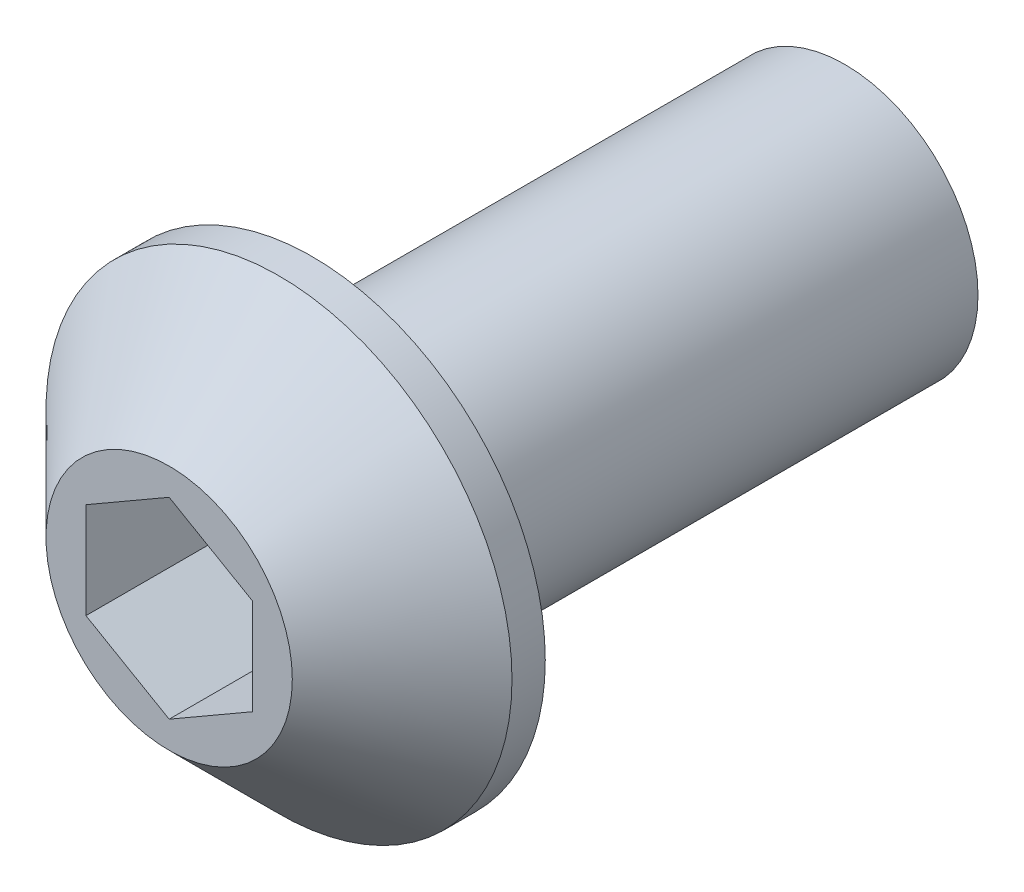
ISO-10303-21;
HEADER;
FILE_DESCRIPTION(('STEP AP214'),'2;1');
FILE_NAME('part.step','',(''),(''),'','','');
FILE_SCHEMA(('AUTOMOTIVE_DESIGN { 1 0 10303 214 1 1 1 1 }'));
ENDSEC;
DATA;
#1=APPLICATION_CONTEXT('core data for automotive mechanical design processes');
#2=APPLICATION_PROTOCOL_DEFINITION('international standard','automotive_design',2000,#1);
#3=PRODUCT_CONTEXT('',#1,'mechanical');
#4=PRODUCT('Part','Part','',(#3));
#5=PRODUCT_RELATED_PRODUCT_CATEGORY('part','',(#4));
#6=PRODUCT_DEFINITION_FORMATION('','',#4);
#7=PRODUCT_DEFINITION_CONTEXT('part definition',#1,'design');
#8=PRODUCT_DEFINITION('design','',#6,#7);
#9=PRODUCT_DEFINITION_SHAPE('','',#8);
#10=(LENGTH_UNIT() NAMED_UNIT(*) SI_UNIT(.MILLI.,.METRE.));
#11=(NAMED_UNIT(*) PLANE_ANGLE_UNIT() SI_UNIT($,.RADIAN.));
#12=(NAMED_UNIT(*) SI_UNIT($,.STERADIAN.) SOLID_ANGLE_UNIT());
#13=UNCERTAINTY_MEASURE_WITH_UNIT(LENGTH_MEASURE(1.E-05),#10,'distance_accuracy_value','');
#14=(GEOMETRIC_REPRESENTATION_CONTEXT(3) GLOBAL_UNCERTAINTY_ASSIGNED_CONTEXT((#13)) GLOBAL_UNIT_ASSIGNED_CONTEXT((#10,
#11,#12)) REPRESENTATION_CONTEXT('',''));
#15=CARTESIAN_POINT('',(0.,0.,0.));
#16=DIRECTION('',(0.,0.,1.));
#17=DIRECTION('',(1.,0.,0.));
#18=AXIS2_PLACEMENT_3D('',#15,#16,#17);
#19=CARTESIAN_POINT('',(0.,0.,0.));
#20=DIRECTION('',(0.,0.,1.));
#21=DIRECTION('',(1.,0.,0.));
#22=AXIS2_PLACEMENT_3D('',#19,#20,#21);
#23=PLANE('',#22);
#24=CARTESIAN_POINT('',(0.,0.,0.));
#25=DIRECTION('',(0.,0.,1.));
#26=DIRECTION('',(1.,0.,0.));
#27=AXIS2_PLACEMENT_3D('',#24,#25,#26);
#28=CIRCLE('',#27,7.);
#29=CARTESIAN_POINT('',(7.,0.,0.));
#30=VERTEX_POINT('',#29);
#31=EDGE_CURVE('E151',#30,#30,#28,.T.);
#32=ORIENTED_EDGE('',*,*,#31,.F.);
#33=EDGE_LOOP('',(#32));
#34=FACE_BOUND('',#33,.T.);
#35=CARTESIAN_POINT('',(0.,0.,0.));
#36=DIRECTION('',(0.,0.,1.));
#37=DIRECTION('',(1.,0.,0.));
#38=AXIS2_PLACEMENT_3D('',#35,#36,#37);
#39=CIRCLE('',#38,4.);
#40=CARTESIAN_POINT('',(4.,0.,0.));
#41=VERTEX_POINT('',#40);
#42=EDGE_CURVE('E154',#41,#41,#39,.F.);
#43=ORIENTED_EDGE('',*,*,#42,.F.);
#44=EDGE_LOOP('',(#43));
#45=FACE_BOUND('',#44,.T.);
#46=ADVANCED_FACE('F41',(#34,#45),#23,.F.);
#47=CARTESIAN_POINT('',(0.,0.,4.3));
#48=DIRECTION('',(0.,0.,-1.));
#49=DIRECTION('',(-1.,0.,0.));
#50=AXIS2_PLACEMENT_3D('',#47,#48,#49);
#51=CYLINDRICAL_SURFACE('',#50,7.);
#52=CARTESIAN_POINT('',(0.,0.,0.999999999999989));
#53=DIRECTION('',(0.,0.,1.));
#54=DIRECTION('',(1.,0.,0.));
#55=AXIS2_PLACEMENT_3D('',#52,#53,#54);
#56=CIRCLE('',#55,7.);
#57=CARTESIAN_POINT('',(7.,0.,0.999999999999989));
#58=VERTEX_POINT('',#57);
#59=EDGE_CURVE('E11',#58,#58,#56,.F.);
#60=ORIENTED_EDGE('',*,*,#59,.T.);
#61=EDGE_LOOP('',(#60));
#62=FACE_BOUND('',#61,.T.);
#63=ORIENTED_EDGE('',*,*,#31,.T.);
#64=EDGE_LOOP('',(#63));
#65=FACE_BOUND('',#64,.T.);
#66=ADVANCED_FACE('F172',(#62,#65),#51,.T.);
#67=CARTESIAN_POINT('',(0.,0.,4.3));
#68=DIRECTION('',(0.,0.,1.));
#69=DIRECTION('',(1.,0.,0.));
#70=AXIS2_PLACEMENT_3D('',#67,#68,#69);
#71=PLANE('',#70);
#72=CARTESIAN_POINT('',(0.,0.,4.3));
#73=DIRECTION('',(0.,0.,1.));
#74=DIRECTION('',(1.,0.,0.));
#75=AXIS2_PLACEMENT_3D('',#72,#73,#74);
#76=CIRCLE('',#75,3.7);
#77=CARTESIAN_POINT('',(3.7,0.,4.3));
#78=VERTEX_POINT('',#77);
#79=EDGE_CURVE('E49',#78,#78,#76,.T.);
#80=ORIENTED_EDGE('',*,*,#79,.T.);
#81=EDGE_LOOP('',(#80));
#82=FACE_BOUND('',#81,.T.);
#83=DIRECTION('',(-0.866025403784439,0.5,0.));
#84=VECTOR('',#83,1.);
#85=CARTESIAN_POINT('',(2.5,1.44337567297406,4.3));
#86=LINE('',#85,#84);
#87=CARTESIAN_POINT('',(2.5,1.44337567297406,4.3));
#88=VERTEX_POINT('',#87);
#89=CARTESIAN_POINT('',(0.,2.88675134594813,4.3));
#90=VERTEX_POINT('',#89);
#91=EDGE_CURVE('E56',#88,#90,#86,.T.);
#92=ORIENTED_EDGE('',*,*,#91,.F.);
#93=DIRECTION('',(0.,1.,0.));
#94=VECTOR('',#93,1.);
#95=CARTESIAN_POINT('',(2.5,-1.44337567297407,4.3));
#96=LINE('',#95,#94);
#97=CARTESIAN_POINT('',(2.5,-1.44337567297407,4.3));
#98=VERTEX_POINT('',#97);
#99=EDGE_CURVE('E139',#98,#88,#96,.T.);
#100=ORIENTED_EDGE('',*,*,#99,.F.);
#101=DIRECTION('',(0.866025403784439,0.5,0.));
#102=VECTOR('',#101,1.);
#103=CARTESIAN_POINT('',(0.,-2.88675134594813,4.3));
#104=LINE('',#103,#102);
#105=CARTESIAN_POINT('',(0.,-2.88675134594813,4.3));
#106=VERTEX_POINT('',#105);
#107=EDGE_CURVE('E137',#106,#98,#104,.T.);
#108=ORIENTED_EDGE('',*,*,#107,.F.);
#109=DIRECTION('',(0.866025403784439,-0.5,0.));
#110=VECTOR('',#109,1.);
#111=CARTESIAN_POINT('',(-2.5,-1.44337567297406,4.3));
#112=LINE('',#111,#110);
#113=CARTESIAN_POINT('',(-2.5,-1.44337567297406,4.3));
#114=VERTEX_POINT('',#113);
#115=EDGE_CURVE('E104',#114,#106,#112,.T.);
#116=ORIENTED_EDGE('',*,*,#115,.F.);
#117=DIRECTION('',(0.,-1.,0.));
#118=VECTOR('',#117,1.);
#119=CARTESIAN_POINT('',(-2.5,1.44337567297407,4.3));
#120=LINE('',#119,#118);
#121=CARTESIAN_POINT('',(-2.5,1.44337567297407,4.3));
#122=VERTEX_POINT('',#121);
#123=EDGE_CURVE('E133',#122,#114,#120,.T.);
#124=ORIENTED_EDGE('',*,*,#123,.F.);
#125=DIRECTION('',(-0.866025403784439,-0.5,0.));
#126=VECTOR('',#125,1.);
#127=CARTESIAN_POINT('',(0.,2.88675134594813,4.3));
#128=LINE('',#127,#126);
#129=EDGE_CURVE('E130',#90,#122,#128,.T.);
#130=ORIENTED_EDGE('',*,*,#129,.F.);
#131=EDGE_LOOP('',(#92,#100,#108,#116,#124,#130));
#132=FACE_BOUND('',#131,.T.);
#133=ADVANCED_FACE('F159',(#82,#132),#71,.T.);
#134=CARTESIAN_POINT('',(0.,0.,-16.));
#135=DIRECTION('',(0.,0.,1.));
#136=DIRECTION('',(1.,0.,0.));
#137=AXIS2_PLACEMENT_3D('',#134,#135,#136);
#138=CYLINDRICAL_SURFACE('',#137,4.);
#139=CARTESIAN_POINT('',(0.,0.,-16.));
#140=DIRECTION('',(0.,0.,-1.));
#141=DIRECTION('',(-1.,0.,0.));
#142=AXIS2_PLACEMENT_3D('',#139,#140,#141);
#143=CIRCLE('',#142,4.);
#144=CARTESIAN_POINT('',(-4.,0.,-16.));
#145=VERTEX_POINT('',#144);
#146=EDGE_CURVE('E143',#145,#145,#143,.T.);
#147=ORIENTED_EDGE('',*,*,#146,.F.);
#148=EDGE_LOOP('',(#147));
#149=FACE_BOUND('',#148,.T.);
#150=ORIENTED_EDGE('',*,*,#42,.T.);
#151=EDGE_LOOP('',(#150));
#152=FACE_BOUND('',#151,.T.);
#153=ADVANCED_FACE('F184',(#149,#152),#138,.T.);
#154=CARTESIAN_POINT('',(0.,0.,-16.));
#155=DIRECTION('',(0.,0.,-1.));
#156=DIRECTION('',(-1.,0.,0.));
#157=AXIS2_PLACEMENT_3D('',#154,#155,#156);
#158=PLANE('',#157);
#159=ORIENTED_EDGE('',*,*,#146,.T.);
#160=EDGE_LOOP('',(#159));
#161=FACE_BOUND('',#160,.T.);
#162=ADVANCED_FACE('F186',(#161),#158,.T.);
#163=CARTESIAN_POINT('',(2.5,1.44337567297406,0.));
#164=DIRECTION('',(0.5,0.866025403784438,0.));
#165=DIRECTION('',(-0.866025403784439,0.5,0.));
#166=AXIS2_PLACEMENT_3D('',#163,#164,#165);
#167=PLANE('',#166);
#168=ORIENTED_EDGE('',*,*,#91,.T.);
#169=DIRECTION('',(0.,0.,1.));
#170=VECTOR('',#169,1.);
#171=CARTESIAN_POINT('',(0.,2.88675134594813,0.));
#172=LINE('',#171,#170);
#173=CARTESIAN_POINT('',(0.,2.88675134594813,0.));
#174=VERTEX_POINT('',#173);
#175=EDGE_CURVE('E86',#174,#90,#172,.T.);
#176=ORIENTED_EDGE('',*,*,#175,.F.);
#177=DIRECTION('',(-0.866025403784439,0.5,0.));
#178=VECTOR('',#177,1.);
#179=CARTESIAN_POINT('',(2.5,1.44337567297406,0.));
#180=LINE('',#179,#178);
#181=CARTESIAN_POINT('',(2.5,1.44337567297406,0.));
#182=VERTEX_POINT('',#181);
#183=EDGE_CURVE('E141',#182,#174,#180,.T.);
#184=ORIENTED_EDGE('',*,*,#183,.F.);
#185=DIRECTION('',(0.,0.,1.));
#186=VECTOR('',#185,1.);
#187=CARTESIAN_POINT('',(2.5,1.44337567297406,0.));
#188=LINE('',#187,#186);
#189=EDGE_CURVE('E64',#182,#88,#188,.T.);
#190=ORIENTED_EDGE('',*,*,#189,.T.);
#191=EDGE_LOOP('',(#168,#176,#184,#190));
#192=FACE_BOUND('',#191,.T.);
#193=ADVANCED_FACE('F190',(#192),#167,.F.);
#194=CARTESIAN_POINT('',(2.5,-1.44337567297407,0.));
#195=DIRECTION('',(1.,0.,0.));
#196=DIRECTION('',(0.,0.,-1.));
#197=AXIS2_PLACEMENT_3D('',#194,#195,#196);
#198=PLANE('',#197);
#199=ORIENTED_EDGE('',*,*,#99,.T.);
#200=ORIENTED_EDGE('',*,*,#189,.F.);
#201=DIRECTION('',(0.,1.,0.));
#202=VECTOR('',#201,1.);
#203=CARTESIAN_POINT('',(2.5,-1.44337567297407,0.));
#204=LINE('',#203,#202);
#205=CARTESIAN_POINT('',(2.5,-1.44337567297407,0.));
#206=VERTEX_POINT('',#205);
#207=EDGE_CURVE('E116',#206,#182,#204,.T.);
#208=ORIENTED_EDGE('',*,*,#207,.F.);
#209=DIRECTION('',(0.,0.,1.));
#210=VECTOR('',#209,1.);
#211=CARTESIAN_POINT('',(2.5,-1.44337567297407,0.));
#212=LINE('',#211,#210);
#213=EDGE_CURVE('E108',#206,#98,#212,.T.);
#214=ORIENTED_EDGE('',*,*,#213,.T.);
#215=EDGE_LOOP('',(#199,#200,#208,#214));
#216=FACE_BOUND('',#215,.T.);
#217=ADVANCED_FACE('F194',(#216),#198,.F.);
#218=CARTESIAN_POINT('',(0.,-2.88675134594813,0.));
#219=DIRECTION('',(0.5,-0.866025403784439,0.));
#220=DIRECTION('',(0.866025403784439,0.5,0.));
#221=AXIS2_PLACEMENT_3D('',#218,#219,#220);
#222=PLANE('',#221);
#223=ORIENTED_EDGE('',*,*,#107,.T.);
#224=ORIENTED_EDGE('',*,*,#213,.F.);
#225=DIRECTION('',(0.866025403784439,0.5,0.));
#226=VECTOR('',#225,1.);
#227=CARTESIAN_POINT('',(0.,-2.88675134594813,0.));
#228=LINE('',#227,#226);
#229=CARTESIAN_POINT('',(0.,-2.88675134594813,0.));
#230=VERTEX_POINT('',#229);
#231=EDGE_CURVE('E112',#230,#206,#228,.T.);
#232=ORIENTED_EDGE('',*,*,#231,.F.);
#233=DIRECTION('',(0.,0.,1.));
#234=VECTOR('',#233,1.);
#235=CARTESIAN_POINT('',(0.,-2.88675134594813,0.));
#236=LINE('',#235,#234);
#237=EDGE_CURVE('E97',#230,#106,#236,.T.);
#238=ORIENTED_EDGE('',*,*,#237,.T.);
#239=EDGE_LOOP('',(#223,#224,#232,#238));
#240=FACE_BOUND('',#239,.T.);
#241=ADVANCED_FACE('F113',(#240),#222,.F.);
#242=CARTESIAN_POINT('',(-2.5,-1.44337567297406,0.));
#243=DIRECTION('',(-0.5,-0.866025403784438,0.));
#244=DIRECTION('',(0.866025403784439,-0.5,0.));
#245=AXIS2_PLACEMENT_3D('',#242,#243,#244);
#246=PLANE('',#245);
#247=ORIENTED_EDGE('',*,*,#115,.T.);
#248=ORIENTED_EDGE('',*,*,#237,.F.);
#249=DIRECTION('',(0.866025403784439,-0.5,0.));
#250=VECTOR('',#249,1.);
#251=CARTESIAN_POINT('',(-2.5,-1.44337567297406,0.));
#252=LINE('',#251,#250);
#253=CARTESIAN_POINT('',(-2.5,-1.44337567297406,0.));
#254=VERTEX_POINT('',#253);
#255=EDGE_CURVE('E101',#254,#230,#252,.T.);
#256=ORIENTED_EDGE('',*,*,#255,.F.);
#257=DIRECTION('',(0.,0.,1.));
#258=VECTOR('',#257,1.);
#259=CARTESIAN_POINT('',(-2.5,-1.44337567297406,0.));
#260=LINE('',#259,#258);
#261=EDGE_CURVE('E109',#254,#114,#260,.T.);
#262=ORIENTED_EDGE('',*,*,#261,.T.);
#263=EDGE_LOOP('',(#247,#248,#256,#262));
#264=FACE_BOUND('',#263,.T.);
#265=ADVANCED_FACE('F99',(#264),#246,.F.);
#266=CARTESIAN_POINT('',(-2.5,1.44337567297407,0.));
#267=DIRECTION('',(-1.,0.,0.));
#268=DIRECTION('',(0.,-1.,0.));
#269=AXIS2_PLACEMENT_3D('',#266,#267,#268);
#270=PLANE('',#269);
#271=ORIENTED_EDGE('',*,*,#123,.T.);
#272=ORIENTED_EDGE('',*,*,#261,.F.);
#273=DIRECTION('',(0.,-1.,0.));
#274=VECTOR('',#273,1.);
#275=CARTESIAN_POINT('',(-2.5,1.44337567297407,0.));
#276=LINE('',#275,#274);
#277=CARTESIAN_POINT('',(-2.5,1.44337567297407,0.));
#278=VERTEX_POINT('',#277);
#279=EDGE_CURVE('E122',#278,#254,#276,.T.);
#280=ORIENTED_EDGE('',*,*,#279,.F.);
#281=DIRECTION('',(0.,0.,1.));
#282=VECTOR('',#281,1.);
#283=CARTESIAN_POINT('',(-2.5,1.44337567297407,0.));
#284=LINE('',#283,#282);
#285=EDGE_CURVE('E146',#278,#122,#284,.T.);
#286=ORIENTED_EDGE('',*,*,#285,.T.);
#287=EDGE_LOOP('',(#271,#272,#280,#286));
#288=FACE_BOUND('',#287,.T.);
#289=ADVANCED_FACE('F197',(#288),#270,.F.);
#290=CARTESIAN_POINT('',(0.,2.88675134594813,0.));
#291=DIRECTION('',(-0.5,0.866025403784439,0.));
#292=DIRECTION('',(-0.866025403784439,-0.5,0.));
#293=AXIS2_PLACEMENT_3D('',#290,#291,#292);
#294=PLANE('',#293);
#295=ORIENTED_EDGE('',*,*,#129,.T.);
#296=ORIENTED_EDGE('',*,*,#285,.F.);
#297=DIRECTION('',(-0.866025403784439,-0.5,0.));
#298=VECTOR('',#297,1.);
#299=CARTESIAN_POINT('',(0.,2.88675134594813,0.));
#300=LINE('',#299,#298);
#301=EDGE_CURVE('E124',#174,#278,#300,.T.);
#302=ORIENTED_EDGE('',*,*,#301,.F.);
#303=ORIENTED_EDGE('',*,*,#175,.T.);
#304=EDGE_LOOP('',(#295,#296,#302,#303));
#305=FACE_BOUND('',#304,.T.);
#306=ADVANCED_FACE('F168',(#305),#294,.F.);
#307=CARTESIAN_POINT('',(0.,2.88675134594813,0.));
#308=DIRECTION('',(0.,0.,1.));
#309=DIRECTION('',(1.,0.,0.));
#310=AXIS2_PLACEMENT_3D('',#307,#308,#309);
#311=PLANE('',#310);
#312=ORIENTED_EDGE('',*,*,#183,.T.);
#313=ORIENTED_EDGE('',*,*,#301,.T.);
#314=ORIENTED_EDGE('',*,*,#279,.T.);
#315=ORIENTED_EDGE('',*,*,#255,.T.);
#316=ORIENTED_EDGE('',*,*,#231,.T.);
#317=ORIENTED_EDGE('',*,*,#207,.T.);
#318=EDGE_LOOP('',(#312,#313,#314,#315,#316,#317));
#319=FACE_BOUND('',#318,.T.);
#320=ADVANCED_FACE('F119',(#319),#311,.T.);
#321=CARTESIAN_POINT('',(0.,0.,4.3));
#322=DIRECTION('',(0.,0.,-1.));
#323=DIRECTION('',(-1.,0.,0.));
#324=AXIS2_PLACEMENT_3D('',#321,#322,#323);
#325=CONICAL_SURFACE('',#324,3.7,0.785398163397447);
#326=ORIENTED_EDGE('',*,*,#59,.F.);
#327=EDGE_LOOP('',(#326));
#328=FACE_BOUND('',#327,.T.);
#329=ORIENTED_EDGE('',*,*,#79,.F.);
#330=EDGE_LOOP('',(#329));
#331=FACE_BOUND('',#330,.T.);
#332=ADVANCED_FACE('F43',(#328,#331),#325,.T.);
#333=CLOSED_SHELL('',(#46,#66,#133,#153,#162,#193,#217,#241,#265,#289,#306,#320,#332));
#334=MANIFOLD_SOLID_BREP('B2',#333);
#335=ADVANCED_BREP_SHAPE_REPRESENTATION('',(#18,#334),#14);
#336=SHAPE_DEFINITION_REPRESENTATION(#9,#335);
ENDSEC;
END-ISO-10303-21;
